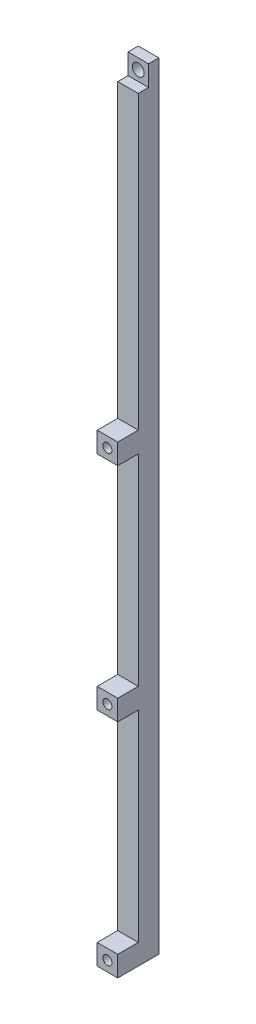
ISO-10303-21;
HEADER;
FILE_DESCRIPTION(('STEP AP214'),'2;1');
FILE_NAME('part.step','',(''),(''),'','','');
FILE_SCHEMA(('AUTOMOTIVE_DESIGN { 1 0 10303 214 1 1 1 1 }'));
ENDSEC;
DATA;
#1=APPLICATION_CONTEXT('core data for automotive mechanical design processes');
#2=APPLICATION_PROTOCOL_DEFINITION('international standard','automotive_design',2000,#1);
#3=PRODUCT_CONTEXT('',#1,'mechanical');
#4=PRODUCT('Part','Part','',(#3));
#5=PRODUCT_RELATED_PRODUCT_CATEGORY('part','',(#4));
#6=PRODUCT_DEFINITION_FORMATION('','',#4);
#7=PRODUCT_DEFINITION_CONTEXT('part definition',#1,'design');
#8=PRODUCT_DEFINITION('design','',#6,#7);
#9=PRODUCT_DEFINITION_SHAPE('','',#8);
#10=(LENGTH_UNIT() NAMED_UNIT(*) SI_UNIT(.MILLI.,.METRE.));
#11=(NAMED_UNIT(*) PLANE_ANGLE_UNIT() SI_UNIT($,.RADIAN.));
#12=(NAMED_UNIT(*) SI_UNIT($,.STERADIAN.) SOLID_ANGLE_UNIT());
#13=UNCERTAINTY_MEASURE_WITH_UNIT(LENGTH_MEASURE(1.E-05),#10,'distance_accuracy_value','');
#14=(GEOMETRIC_REPRESENTATION_CONTEXT(3) GLOBAL_UNCERTAINTY_ASSIGNED_CONTEXT((#13)) GLOBAL_UNIT_ASSIGNED_CONTEXT((#10,
#11,#12)) REPRESENTATION_CONTEXT('',''));
#15=CARTESIAN_POINT('',(0.,0.,0.));
#16=DIRECTION('',(0.,0.,1.));
#17=DIRECTION('',(1.,0.,0.));
#18=AXIS2_PLACEMENT_3D('',#15,#16,#17);
#19=CARTESIAN_POINT('',(0.,240.03,0.));
#20=DIRECTION('',(0.,0.,-1.));
#21=DIRECTION('',(-1.,0.,0.));
#22=AXIS2_PLACEMENT_3D('',#19,#20,#21);
#23=PLANE('',#22);
#24=CARTESIAN_POINT('',(3.175,140.335,0.));
#25=DIRECTION('',(0.,0.,1.));
#26=DIRECTION('',(1.,0.,0.));
#27=AXIS2_PLACEMENT_3D('',#24,#25,#26);
#28=CIRCLE('',#27,1.397);
#29=CARTESIAN_POINT('',(4.57199999999999,140.335,0.));
#30=VERTEX_POINT('',#29);
#31=EDGE_CURVE('E396',#30,#30,#28,.T.);
#32=ORIENTED_EDGE('',*,*,#31,.F.);
#33=EDGE_LOOP('',(#32));
#34=FACE_BOUND('',#33,.T.);
#35=DIRECTION('',(0.,-1.,0.));
#36=VECTOR('',#35,1.);
#37=CARTESIAN_POINT('',(6.35,240.03,0.));
#38=LINE('',#37,#36);
#39=CARTESIAN_POINT('',(6.35,143.50989967,0.));
#40=VERTEX_POINT('',#39);
#41=CARTESIAN_POINT('',(6.35,137.16010033,0.));
#42=VERTEX_POINT('',#41);
#43=EDGE_CURVE('E206',#40,#42,#38,.T.);
#44=ORIENTED_EDGE('',*,*,#43,.F.);
#45=DIRECTION('',(-1.,0.,0.));
#46=VECTOR('',#45,1.);
#47=CARTESIAN_POINT('',(0.,143.50989967,0.));
#48=LINE('',#47,#46);
#49=CARTESIAN_POINT('',(0.,143.50989967,0.));
#50=VERTEX_POINT('',#49);
#51=EDGE_CURVE('E127',#40,#50,#48,.T.);
#52=ORIENTED_EDGE('',*,*,#51,.T.);
#53=DIRECTION('',(0.,-1.,0.));
#54=VECTOR('',#53,1.);
#55=CARTESIAN_POINT('',(0.,240.03,0.));
#56=LINE('',#55,#54);
#57=CARTESIAN_POINT('',(0.,137.16010033,0.));
#58=VERTEX_POINT('',#57);
#59=EDGE_CURVE('E202',#50,#58,#56,.T.);
#60=ORIENTED_EDGE('',*,*,#59,.T.);
#61=DIRECTION('',(1.,0.,0.));
#62=VECTOR('',#61,1.);
#63=CARTESIAN_POINT('',(0.,137.16010033,0.));
#64=LINE('',#63,#62);
#65=EDGE_CURVE('E201',#58,#42,#64,.T.);
#66=ORIENTED_EDGE('',*,*,#65,.T.);
#67=EDGE_LOOP('',(#44,#52,#60,#66));
#68=FACE_BOUND('',#67,.T.);
#69=ADVANCED_FACE('F109',(#34,#68),#23,.F.);
#70=CARTESIAN_POINT('',(3.175,3.174949835,0.));
#71=DIRECTION('',(0.,0.,1.));
#72=DIRECTION('',(1.,0.,0.));
#73=AXIS2_PLACEMENT_3D('',#70,#71,#72);
#74=CIRCLE('',#73,1.397);
#75=CARTESIAN_POINT('',(4.572,3.174949835,0.));
#76=VERTEX_POINT('',#75);
#77=EDGE_CURVE('E393',#76,#76,#74,.T.);
#78=ORIENTED_EDGE('',*,*,#77,.F.);
#79=EDGE_LOOP('',(#78));
#80=FACE_BOUND('',#79,.T.);
#81=DIRECTION('',(1.,0.,0.));
#82=VECTOR('',#81,1.);
#83=CARTESIAN_POINT('',(0.,6.34989966999999,0.));
#84=LINE('',#83,#82);
#85=CARTESIAN_POINT('',(0.,6.34989967,0.));
#86=VERTEX_POINT('',#85);
#87=CARTESIAN_POINT('',(6.35,6.34989967,0.));
#88=VERTEX_POINT('',#87);
#89=EDGE_CURVE('E238',#86,#88,#84,.T.);
#90=ORIENTED_EDGE('',*,*,#89,.F.);
#91=CARTESIAN_POINT('',(0.,0.,0.));
#92=VERTEX_POINT('',#91);
#93=EDGE_CURVE('E197',#86,#92,#56,.T.);
#94=ORIENTED_EDGE('',*,*,#93,.T.);
#95=DIRECTION('',(1.,0.,0.));
#96=VECTOR('',#95,1.);
#97=CARTESIAN_POINT('',(0.,0.,0.));
#98=LINE('',#97,#96);
#99=CARTESIAN_POINT('',(6.35,0.,0.));
#100=VERTEX_POINT('',#99);
#101=EDGE_CURVE('E200',#92,#100,#98,.T.);
#102=ORIENTED_EDGE('',*,*,#101,.T.);
#103=EDGE_CURVE('E186',#88,#100,#38,.T.);
#104=ORIENTED_EDGE('',*,*,#103,.F.);
#105=EDGE_LOOP('',(#90,#94,#102,#104));
#106=FACE_BOUND('',#105,.T.);
#107=ADVANCED_FACE('F372',(#80,#106),#23,.F.);
#108=CARTESIAN_POINT('',(3.175,71.755,0.));
#109=DIRECTION('',(0.,0.,1.));
#110=DIRECTION('',(1.,0.,0.));
#111=AXIS2_PLACEMENT_3D('',#108,#109,#110);
#112=CIRCLE('',#111,1.397);
#113=CARTESIAN_POINT('',(4.572,71.755,0.));
#114=VERTEX_POINT('',#113);
#115=EDGE_CURVE('E387',#114,#114,#112,.T.);
#116=ORIENTED_EDGE('',*,*,#115,.F.);
#117=EDGE_LOOP('',(#116));
#118=FACE_BOUND('',#117,.T.);
#119=CARTESIAN_POINT('',(0.,74.92989967,0.));
#120=VERTEX_POINT('',#119);
#121=CARTESIAN_POINT('',(0.,68.58010033,0.));
#122=VERTEX_POINT('',#121);
#123=EDGE_CURVE('E203',#120,#122,#56,.T.);
#124=ORIENTED_EDGE('',*,*,#123,.T.);
#125=DIRECTION('',(1.,0.,0.));
#126=VECTOR('',#125,1.);
#127=CARTESIAN_POINT('',(0.,68.58010033,0.));
#128=LINE('',#127,#126);
#129=CARTESIAN_POINT('',(6.35,68.58010033,0.));
#130=VERTEX_POINT('',#129);
#131=EDGE_CURVE('E195',#122,#130,#128,.T.);
#132=ORIENTED_EDGE('',*,*,#131,.T.);
#133=CARTESIAN_POINT('',(6.35,74.92989967,0.));
#134=VERTEX_POINT('',#133);
#135=EDGE_CURVE('E207',#134,#130,#38,.T.);
#136=ORIENTED_EDGE('',*,*,#135,.F.);
#137=DIRECTION('',(1.,0.,0.));
#138=VECTOR('',#137,1.);
#139=CARTESIAN_POINT('',(0.,74.92989967,0.));
#140=LINE('',#139,#138);
#141=EDGE_CURVE('E255',#120,#134,#140,.T.);
#142=ORIENTED_EDGE('',*,*,#141,.F.);
#143=EDGE_LOOP('',(#124,#132,#136,#142));
#144=FACE_BOUND('',#143,.T.);
#145=ADVANCED_FACE('F308',(#118,#144),#23,.F.);
#146=CARTESIAN_POINT('',(0.,240.03,0.));
#147=DIRECTION('',(1.,0.,0.));
#148=DIRECTION('',(0.,0.,-1.));
#149=AXIS2_PLACEMENT_3D('',#146,#147,#148);
#150=PLANE('',#149);
#151=ORIENTED_EDGE('',*,*,#59,.F.);
#152=DIRECTION('',(0.,0.,1.));
#153=VECTOR('',#152,1.);
#154=CARTESIAN_POINT('',(0.,143.50989967,0.));
#155=LINE('',#154,#153);
#156=CARTESIAN_POINT('',(0.,143.50989967,-6.35010033));
#157=VERTEX_POINT('',#156);
#158=EDGE_CURVE('E12',#157,#50,#155,.T.);
#159=ORIENTED_EDGE('',*,*,#158,.F.);
#160=DIRECTION('',(0.,1.,0.));
#161=VECTOR('',#160,1.);
#162=CARTESIAN_POINT('',(0.,143.51,-6.35010033));
#163=LINE('',#162,#161);
#164=CARTESIAN_POINT('',(0.,233.67989967,-6.35010033));
#165=VERTEX_POINT('',#164);
#166=EDGE_CURVE('E172',#165,#157,#163,.F.);
#167=ORIENTED_EDGE('',*,*,#166,.F.);
#168=DIRECTION('',(0.,0.,-1.));
#169=VECTOR('',#168,1.);
#170=CARTESIAN_POINT('',(0.,233.67989967,0.));
#171=LINE('',#170,#169);
#172=CARTESIAN_POINT('',(0.,233.67989967,-9.52510033));
#173=VERTEX_POINT('',#172);
#174=EDGE_CURVE('E193',#165,#173,#171,.T.);
#175=ORIENTED_EDGE('',*,*,#174,.T.);
#176=DIRECTION('',(0.,-1.,0.));
#177=VECTOR('',#176,1.);
#178=CARTESIAN_POINT('',(0.,0.,-9.52510032999994));
#179=LINE('',#178,#177);
#180=CARTESIAN_POINT('',(0.,240.03,-9.52510033));
#181=VERTEX_POINT('',#180);
#182=EDGE_CURVE('E171',#181,#173,#179,.T.);
#183=ORIENTED_EDGE('',*,*,#182,.F.);
#184=DIRECTION('',(0.,0.,1.));
#185=VECTOR('',#184,1.);
#186=CARTESIAN_POINT('',(0.,240.03,0.));
#187=LINE('',#186,#185);
#188=CARTESIAN_POINT('',(0.,240.03,-12.7));
#189=VERTEX_POINT('',#188);
#190=EDGE_CURVE('E113',#189,#181,#187,.T.);
#191=ORIENTED_EDGE('',*,*,#190,.F.);
#192=DIRECTION('',(0.,-1.,0.));
#193=VECTOR('',#192,1.);
#194=CARTESIAN_POINT('',(0.,240.03,-12.7));
#195=LINE('',#194,#193);
#196=CARTESIAN_POINT('',(0.,0.,-12.7));
#197=VERTEX_POINT('',#196);
#198=EDGE_CURVE('E194',#189,#197,#195,.T.);
#199=ORIENTED_EDGE('',*,*,#198,.T.);
#200=DIRECTION('',(0.,0.,1.));
#201=VECTOR('',#200,1.);
#202=CARTESIAN_POINT('',(0.,0.,0.));
#203=LINE('',#202,#201);
#204=EDGE_CURVE('E232',#197,#92,#203,.T.);
#205=ORIENTED_EDGE('',*,*,#204,.T.);
#206=ORIENTED_EDGE('',*,*,#93,.F.);
#207=DIRECTION('',(0.,0.,-1.));
#208=VECTOR('',#207,1.);
#209=CARTESIAN_POINT('',(0.,6.34989967,0.));
#210=LINE('',#209,#208);
#211=CARTESIAN_POINT('',(0.,6.34989967,-6.35010032999999));
#212=VERTEX_POINT('',#211);
#213=EDGE_CURVE('E228',#86,#212,#210,.T.);
#214=ORIENTED_EDGE('',*,*,#213,.T.);
#215=DIRECTION('',(0.,-1.,0.));
#216=VECTOR('',#215,1.);
#217=CARTESIAN_POINT('',(0.,68.58,-6.35010033));
#218=LINE('',#217,#216);
#219=CARTESIAN_POINT('',(0.,68.58010033,-6.35010033));
#220=VERTEX_POINT('',#219);
#221=EDGE_CURVE('E223',#220,#212,#218,.T.);
#222=ORIENTED_EDGE('',*,*,#221,.F.);
#223=DIRECTION('',(0.,0.,-1.));
#224=VECTOR('',#223,1.);
#225=CARTESIAN_POINT('',(0.,68.58010033,0.));
#226=LINE('',#225,#224);
#227=EDGE_CURVE('E235',#122,#220,#226,.T.);
#228=ORIENTED_EDGE('',*,*,#227,.F.);
#229=ORIENTED_EDGE('',*,*,#123,.F.);
#230=DIRECTION('',(0.,0.,-1.));
#231=VECTOR('',#230,1.);
#232=CARTESIAN_POINT('',(0.,74.92989967,0.));
#233=LINE('',#232,#231);
#234=CARTESIAN_POINT('',(0.,74.92989967,-6.35010032999999));
#235=VERTEX_POINT('',#234);
#236=EDGE_CURVE('E231',#120,#235,#233,.T.);
#237=ORIENTED_EDGE('',*,*,#236,.T.);
#238=DIRECTION('',(0.,-1.,0.));
#239=VECTOR('',#238,1.);
#240=CARTESIAN_POINT('',(0.,137.16,-6.35010033));
#241=LINE('',#240,#239);
#242=CARTESIAN_POINT('',(0.,137.16010033,-6.35010033));
#243=VERTEX_POINT('',#242);
#244=EDGE_CURVE('E270',#243,#235,#241,.T.);
#245=ORIENTED_EDGE('',*,*,#244,.F.);
#246=DIRECTION('',(0.,0.,-1.));
#247=VECTOR('',#246,1.);
#248=CARTESIAN_POINT('',(0.,137.16010033,0.));
#249=LINE('',#248,#247);
#250=EDGE_CURVE('E213',#58,#243,#249,.T.);
#251=ORIENTED_EDGE('',*,*,#250,.F.);
#252=EDGE_LOOP('',(#151,#159,#167,#175,#183,#191,#199,#205,#206,#214,#222,#228,#229,#237,#245,#251));
#253=FACE_BOUND('',#252,.T.);
#254=ADVANCED_FACE('F111',(#253),#150,.F.);
#255=CARTESIAN_POINT('',(6.35,240.03,0.));
#256=DIRECTION('',(-1.,0.,0.));
#257=DIRECTION('',(0.,0.,1.));
#258=AXIS2_PLACEMENT_3D('',#255,#256,#257);
#259=PLANE('',#258);
#260=DIRECTION('',(0.,1.,0.));
#261=VECTOR('',#260,1.);
#262=CARTESIAN_POINT('',(6.35,143.51,-6.35010033));
#263=LINE('',#262,#261);
#264=CARTESIAN_POINT('',(6.35,233.67989967,-6.35010033));
#265=VERTEX_POINT('',#264);
#266=CARTESIAN_POINT('',(6.35,143.50989967,-6.35010033));
#267=VERTEX_POINT('',#266);
#268=EDGE_CURVE('E275',#265,#267,#263,.F.);
#269=ORIENTED_EDGE('',*,*,#268,.T.);
#270=DIRECTION('',(0.,0.,1.));
#271=VECTOR('',#270,1.);
#272=CARTESIAN_POINT('',(6.35,143.50989967,0.));
#273=LINE('',#272,#271);
#274=EDGE_CURVE('E288',#267,#40,#273,.T.);
#275=ORIENTED_EDGE('',*,*,#274,.T.);
#276=ORIENTED_EDGE('',*,*,#43,.T.);
#277=DIRECTION('',(0.,0.,-1.));
#278=VECTOR('',#277,1.);
#279=CARTESIAN_POINT('',(6.35,137.16010033,0.));
#280=LINE('',#279,#278);
#281=CARTESIAN_POINT('',(6.35,137.16010033,-6.35010033));
#282=VERTEX_POINT('',#281);
#283=EDGE_CURVE('E247',#42,#282,#280,.T.);
#284=ORIENTED_EDGE('',*,*,#283,.T.);
#285=DIRECTION('',(0.,-1.,0.));
#286=VECTOR('',#285,1.);
#287=CARTESIAN_POINT('',(6.35,137.16,-6.35010033));
#288=LINE('',#287,#286);
#289=CARTESIAN_POINT('',(6.35,74.92989967,-6.35010032999999));
#290=VERTEX_POINT('',#289);
#291=EDGE_CURVE('E250',#282,#290,#288,.T.);
#292=ORIENTED_EDGE('',*,*,#291,.T.);
#293=DIRECTION('',(0.,0.,-1.));
#294=VECTOR('',#293,1.);
#295=CARTESIAN_POINT('',(6.35,74.92989967,0.));
#296=LINE('',#295,#294);
#297=EDGE_CURVE('E251',#134,#290,#296,.T.);
#298=ORIENTED_EDGE('',*,*,#297,.F.);
#299=ORIENTED_EDGE('',*,*,#135,.T.);
#300=DIRECTION('',(0.,0.,-1.));
#301=VECTOR('',#300,1.);
#302=CARTESIAN_POINT('',(6.35,68.58010033,0.));
#303=LINE('',#302,#301);
#304=CARTESIAN_POINT('',(6.35,68.58010033,-6.35010033));
#305=VERTEX_POINT('',#304);
#306=EDGE_CURVE('E242',#130,#305,#303,.T.);
#307=ORIENTED_EDGE('',*,*,#306,.T.);
#308=DIRECTION('',(0.,-1.,0.));
#309=VECTOR('',#308,1.);
#310=CARTESIAN_POINT('',(6.35,68.58,-6.35010033));
#311=LINE('',#310,#309);
#312=CARTESIAN_POINT('',(6.35,6.34989966999999,-6.35010032999999));
#313=VERTEX_POINT('',#312);
#314=EDGE_CURVE('E205',#305,#313,#311,.T.);
#315=ORIENTED_EDGE('',*,*,#314,.T.);
#316=DIRECTION('',(0.,0.,-1.));
#317=VECTOR('',#316,1.);
#318=CARTESIAN_POINT('',(6.35,6.34989966999999,0.));
#319=LINE('',#318,#317);
#320=EDGE_CURVE('E227',#88,#313,#319,.T.);
#321=ORIENTED_EDGE('',*,*,#320,.F.);
#322=ORIENTED_EDGE('',*,*,#103,.T.);
#323=DIRECTION('',(0.,0.,-1.));
#324=VECTOR('',#323,1.);
#325=CARTESIAN_POINT('',(6.35,0.,0.));
#326=LINE('',#325,#324);
#327=CARTESIAN_POINT('',(6.35,0.,-12.7));
#328=VERTEX_POINT('',#327);
#329=EDGE_CURVE('E180',#100,#328,#326,.T.);
#330=ORIENTED_EDGE('',*,*,#329,.T.);
#331=DIRECTION('',(0.,-1.,0.));
#332=VECTOR('',#331,1.);
#333=CARTESIAN_POINT('',(6.35,240.03,-12.7));
#334=LINE('',#333,#332);
#335=CARTESIAN_POINT('',(6.35,240.03,-12.7));
#336=VERTEX_POINT('',#335);
#337=EDGE_CURVE('E183',#336,#328,#334,.T.);
#338=ORIENTED_EDGE('',*,*,#337,.F.);
#339=DIRECTION('',(0.,0.,-1.));
#340=VECTOR('',#339,1.);
#341=CARTESIAN_POINT('',(6.35,240.03,0.));
#342=LINE('',#341,#340);
#343=CARTESIAN_POINT('',(6.35,240.03,-9.52510033));
#344=VERTEX_POINT('',#343);
#345=EDGE_CURVE('E178',#344,#336,#342,.T.);
#346=ORIENTED_EDGE('',*,*,#345,.F.);
#347=DIRECTION('',(0.,-1.,0.));
#348=VECTOR('',#347,1.);
#349=CARTESIAN_POINT('',(6.35,0.,-9.52510032999994));
#350=LINE('',#349,#348);
#351=CARTESIAN_POINT('',(6.35,233.67989967,-9.52510033));
#352=VERTEX_POINT('',#351);
#353=EDGE_CURVE('E168',#344,#352,#350,.T.);
#354=ORIENTED_EDGE('',*,*,#353,.T.);
#355=DIRECTION('',(0.,0.,-1.));
#356=VECTOR('',#355,1.);
#357=CARTESIAN_POINT('',(6.35,233.67989967,0.));
#358=LINE('',#357,#356);
#359=EDGE_CURVE('E152',#265,#352,#358,.T.);
#360=ORIENTED_EDGE('',*,*,#359,.F.);
#361=EDGE_LOOP('',(#269,#275,#276,#284,#292,#298,#299,#307,#315,#321,#322,#330,#338,#346,#354,#360));
#362=FACE_BOUND('',#361,.T.);
#363=ADVANCED_FACE('F175',(#362),#259,.F.);
#364=CARTESIAN_POINT('',(0.,240.03,-12.7));
#365=DIRECTION('',(0.,0.,1.));
#366=DIRECTION('',(1.,0.,0.));
#367=AXIS2_PLACEMENT_3D('',#364,#365,#366);
#368=PLANE('',#367);
#369=CARTESIAN_POINT('',(3.175,236.854949835,-12.7));
#370=DIRECTION('',(0.,0.,1.));
#371=DIRECTION('',(1.,0.,0.));
#372=AXIS2_PLACEMENT_3D('',#369,#370,#371);
#373=CIRCLE('',#372,1.8288);
#374=CARTESIAN_POINT('',(5.00379999999999,236.854949835,-12.7));
#375=VERTEX_POINT('',#374);
#376=EDGE_CURVE('E565',#375,#375,#373,.T.);
#377=ORIENTED_EDGE('',*,*,#376,.T.);
#378=EDGE_LOOP('',(#377));
#379=FACE_BOUND('',#378,.T.);
#380=CARTESIAN_POINT('',(3.175,140.335,-12.7));
#381=DIRECTION('',(0.,0.,1.));
#382=DIRECTION('',(1.,0.,0.));
#383=AXIS2_PLACEMENT_3D('',#380,#381,#382);
#384=CIRCLE('',#383,1.397);
#385=CARTESIAN_POINT('',(4.57199999999999,140.335,-12.7));
#386=VERTEX_POINT('',#385);
#387=EDGE_CURVE('E390',#386,#386,#384,.T.);
#388=ORIENTED_EDGE('',*,*,#387,.T.);
#389=EDGE_LOOP('',(#388));
#390=FACE_BOUND('',#389,.T.);
#391=CARTESIAN_POINT('',(3.175,71.755,-12.7));
#392=DIRECTION('',(0.,0.,1.));
#393=DIRECTION('',(1.,0.,0.));
#394=AXIS2_PLACEMENT_3D('',#391,#392,#393);
#395=CIRCLE('',#394,1.397);
#396=CARTESIAN_POINT('',(4.57199999999999,71.755,-12.7));
#397=VERTEX_POINT('',#396);
#398=EDGE_CURVE('E389',#397,#397,#395,.T.);
#399=ORIENTED_EDGE('',*,*,#398,.T.);
#400=EDGE_LOOP('',(#399));
#401=FACE_BOUND('',#400,.T.);
#402=CARTESIAN_POINT('',(3.175,3.174949835,-12.7));
#403=DIRECTION('',(0.,0.,1.));
#404=DIRECTION('',(1.,0.,0.));
#405=AXIS2_PLACEMENT_3D('',#402,#403,#404);
#406=CIRCLE('',#405,1.397);
#407=CARTESIAN_POINT('',(4.572,3.174949835,-12.7));
#408=VERTEX_POINT('',#407);
#409=EDGE_CURVE('E219',#408,#408,#406,.T.);
#410=ORIENTED_EDGE('',*,*,#409,.T.);
#411=EDGE_LOOP('',(#410));
#412=FACE_BOUND('',#411,.T.);
#413=DIRECTION('',(-1.,0.,0.));
#414=VECTOR('',#413,1.);
#415=CARTESIAN_POINT('',(0.,0.,-12.7));
#416=LINE('',#415,#414);
#417=EDGE_CURVE('E179',#328,#197,#416,.T.);
#418=ORIENTED_EDGE('',*,*,#417,.T.);
#419=ORIENTED_EDGE('',*,*,#198,.F.);
#420=DIRECTION('',(-1.,0.,0.));
#421=VECTOR('',#420,1.);
#422=CARTESIAN_POINT('',(0.,240.03,-12.7));
#423=LINE('',#422,#421);
#424=EDGE_CURVE('E208',#336,#189,#423,.T.);
#425=ORIENTED_EDGE('',*,*,#424,.F.);
#426=ORIENTED_EDGE('',*,*,#337,.T.);
#427=EDGE_LOOP('',(#418,#419,#425,#426));
#428=FACE_BOUND('',#427,.T.);
#429=ADVANCED_FACE('F405',(#379,#390,#401,#412,#428),#368,.F.);
#430=CARTESIAN_POINT('',(0.,240.03,0.));
#431=DIRECTION('',(0.,-1.,0.));
#432=DIRECTION('',(0.,0.,-1.));
#433=AXIS2_PLACEMENT_3D('',#430,#431,#432);
#434=PLANE('',#433);
#435=ORIENTED_EDGE('',*,*,#190,.T.);
#436=DIRECTION('',(1.,0.,0.));
#437=VECTOR('',#436,1.);
#438=CARTESIAN_POINT('',(0.,240.03,-9.52510033));
#439=LINE('',#438,#437);
#440=EDGE_CURVE('E209',#181,#344,#439,.T.);
#441=ORIENTED_EDGE('',*,*,#440,.T.);
#442=ORIENTED_EDGE('',*,*,#345,.T.);
#443=ORIENTED_EDGE('',*,*,#424,.T.);
#444=EDGE_LOOP('',(#435,#441,#442,#443));
#445=FACE_BOUND('',#444,.T.);
#446=ADVANCED_FACE('F436',(#445),#434,.F.);
#447=CARTESIAN_POINT('',(0.,0.,0.));
#448=DIRECTION('',(0.,-1.,0.));
#449=DIRECTION('',(0.,0.,-1.));
#450=AXIS2_PLACEMENT_3D('',#447,#448,#449);
#451=PLANE('',#450);
#452=ORIENTED_EDGE('',*,*,#204,.F.);
#453=ORIENTED_EDGE('',*,*,#417,.F.);
#454=ORIENTED_EDGE('',*,*,#329,.F.);
#455=ORIENTED_EDGE('',*,*,#101,.F.);
#456=EDGE_LOOP('',(#452,#453,#454,#455));
#457=FACE_BOUND('',#456,.T.);
#458=ADVANCED_FACE('F438',(#457),#451,.T.);
#459=CARTESIAN_POINT('',(6.35,137.16010033,0.));
#460=DIRECTION('',(0.,1.,0.));
#461=DIRECTION('',(0.,0.,1.));
#462=AXIS2_PLACEMENT_3D('',#459,#460,#461);
#463=PLANE('',#462);
#464=ORIENTED_EDGE('',*,*,#250,.T.);
#465=DIRECTION('',(-1.,0.,0.));
#466=VECTOR('',#465,1.);
#467=CARTESIAN_POINT('',(6.35,137.16010033,-6.35010033));
#468=LINE('',#467,#466);
#469=EDGE_CURVE('E239',#282,#243,#468,.T.);
#470=ORIENTED_EDGE('',*,*,#469,.F.);
#471=ORIENTED_EDGE('',*,*,#283,.F.);
#472=ORIENTED_EDGE('',*,*,#65,.F.);
#473=EDGE_LOOP('',(#464,#470,#471,#472));
#474=FACE_BOUND('',#473,.T.);
#475=ADVANCED_FACE('F369',(#474),#463,.F.);
#476=CARTESIAN_POINT('',(6.35,74.92989967,0.));
#477=DIRECTION('',(0.,1.,0.));
#478=DIRECTION('',(0.,0.,1.));
#479=AXIS2_PLACEMENT_3D('',#476,#477,#478);
#480=PLANE('',#479);
#481=ORIENTED_EDGE('',*,*,#141,.T.);
#482=ORIENTED_EDGE('',*,*,#297,.T.);
#483=DIRECTION('',(-1.,0.,0.));
#484=VECTOR('',#483,1.);
#485=CARTESIAN_POINT('',(6.35,74.92989967,-6.35010032999999));
#486=LINE('',#485,#484);
#487=EDGE_CURVE('E254',#290,#235,#486,.T.);
#488=ORIENTED_EDGE('',*,*,#487,.T.);
#489=ORIENTED_EDGE('',*,*,#236,.F.);
#490=EDGE_LOOP('',(#481,#482,#488,#489));
#491=FACE_BOUND('',#490,.T.);
#492=ADVANCED_FACE('F444',(#491),#480,.T.);
#493=CARTESIAN_POINT('',(6.35,137.16,-6.35010033));
#494=DIRECTION('',(0.,0.,-1.));
#495=DIRECTION('',(-1.,0.,0.));
#496=AXIS2_PLACEMENT_3D('',#493,#494,#495);
#497=PLANE('',#496);
#498=ORIENTED_EDGE('',*,*,#244,.T.);
#499=ORIENTED_EDGE('',*,*,#487,.F.);
#500=ORIENTED_EDGE('',*,*,#291,.F.);
#501=ORIENTED_EDGE('',*,*,#469,.T.);
#502=EDGE_LOOP('',(#498,#499,#500,#501));
#503=FACE_BOUND('',#502,.T.);
#504=ADVANCED_FACE('F427',(#503),#497,.F.);
#505=CARTESIAN_POINT('',(6.35,68.58010033,0.));
#506=DIRECTION('',(0.,1.,0.));
#507=DIRECTION('',(0.,0.,1.));
#508=AXIS2_PLACEMENT_3D('',#505,#506,#507);
#509=PLANE('',#508);
#510=ORIENTED_EDGE('',*,*,#227,.T.);
#511=DIRECTION('',(-1.,0.,0.));
#512=VECTOR('',#511,1.);
#513=CARTESIAN_POINT('',(6.35,68.58010033,-6.35010033));
#514=LINE('',#513,#512);
#515=EDGE_CURVE('E190',#305,#220,#514,.T.);
#516=ORIENTED_EDGE('',*,*,#515,.F.);
#517=ORIENTED_EDGE('',*,*,#306,.F.);
#518=ORIENTED_EDGE('',*,*,#131,.F.);
#519=EDGE_LOOP('',(#510,#516,#517,#518));
#520=FACE_BOUND('',#519,.T.);
#521=ADVANCED_FACE('F423',(#520),#509,.F.);
#522=CARTESIAN_POINT('',(6.35,6.34989967,0.));
#523=DIRECTION('',(0.,1.,0.));
#524=DIRECTION('',(0.,0.,1.));
#525=AXIS2_PLACEMENT_3D('',#522,#523,#524);
#526=PLANE('',#525);
#527=ORIENTED_EDGE('',*,*,#89,.T.);
#528=ORIENTED_EDGE('',*,*,#320,.T.);
#529=DIRECTION('',(-1.,0.,0.));
#530=VECTOR('',#529,1.);
#531=CARTESIAN_POINT('',(6.35,6.34989967,-6.35010032999999));
#532=LINE('',#531,#530);
#533=EDGE_CURVE('E224',#313,#212,#532,.T.);
#534=ORIENTED_EDGE('',*,*,#533,.T.);
#535=ORIENTED_EDGE('',*,*,#213,.F.);
#536=EDGE_LOOP('',(#527,#528,#534,#535));
#537=FACE_BOUND('',#536,.T.);
#538=ADVANCED_FACE('F426',(#537),#526,.T.);
#539=CARTESIAN_POINT('',(6.35,68.58,-6.35010033));
#540=DIRECTION('',(0.,0.,-1.));
#541=DIRECTION('',(-1.,0.,0.));
#542=AXIS2_PLACEMENT_3D('',#539,#540,#541);
#543=PLANE('',#542);
#544=ORIENTED_EDGE('',*,*,#221,.T.);
#545=ORIENTED_EDGE('',*,*,#533,.F.);
#546=ORIENTED_EDGE('',*,*,#314,.F.);
#547=ORIENTED_EDGE('',*,*,#515,.T.);
#548=EDGE_LOOP('',(#544,#545,#546,#547));
#549=FACE_BOUND('',#548,.T.);
#550=ADVANCED_FACE('F429',(#549),#543,.F.);
#551=CARTESIAN_POINT('',(6.35,0.,-9.52510032999994));
#552=DIRECTION('',(0.,0.,-1.));
#553=DIRECTION('',(0.,1.,0.));
#554=AXIS2_PLACEMENT_3D('',#551,#552,#553);
#555=PLANE('',#554);
#556=CARTESIAN_POINT('',(3.175,236.854949835,-9.52510032999993));
#557=DIRECTION('',(0.,0.,1.));
#558=DIRECTION('',(1.,0.,0.));
#559=AXIS2_PLACEMENT_3D('',#556,#557,#558);
#560=CIRCLE('',#559,1.82879999999999);
#561=CARTESIAN_POINT('',(5.00379999999999,236.854949835,-9.52510032999993));
#562=VERTEX_POINT('',#561);
#563=EDGE_CURVE('E568',#562,#562,#560,.T.);
#564=ORIENTED_EDGE('',*,*,#563,.F.);
#565=EDGE_LOOP('',(#564));
#566=FACE_BOUND('',#565,.T.);
#567=ORIENTED_EDGE('',*,*,#182,.T.);
#568=DIRECTION('',(-1.,0.,0.));
#569=VECTOR('',#568,1.);
#570=CARTESIAN_POINT('',(6.35,233.67989967,-9.52510033));
#571=LINE('',#570,#569);
#572=EDGE_CURVE('E156',#352,#173,#571,.T.);
#573=ORIENTED_EDGE('',*,*,#572,.F.);
#574=ORIENTED_EDGE('',*,*,#353,.F.);
#575=ORIENTED_EDGE('',*,*,#440,.F.);
#576=EDGE_LOOP('',(#567,#573,#574,#575));
#577=FACE_BOUND('',#576,.T.);
#578=ADVANCED_FACE('F167',(#566,#577),#555,.F.);
#579=CARTESIAN_POINT('',(6.35,233.67989967,0.));
#580=DIRECTION('',(0.,1.,0.));
#581=DIRECTION('',(0.,0.,1.));
#582=AXIS2_PLACEMENT_3D('',#579,#580,#581);
#583=PLANE('',#582);
#584=DIRECTION('',(1.,0.,0.));
#585=VECTOR('',#584,1.);
#586=CARTESIAN_POINT('',(6.35,233.67989967,-6.35010033));
#587=LINE('',#586,#585);
#588=EDGE_CURVE('E158',#165,#265,#587,.T.);
#589=ORIENTED_EDGE('',*,*,#588,.T.);
#590=ORIENTED_EDGE('',*,*,#359,.T.);
#591=ORIENTED_EDGE('',*,*,#572,.T.);
#592=ORIENTED_EDGE('',*,*,#174,.F.);
#593=EDGE_LOOP('',(#589,#590,#591,#592));
#594=FACE_BOUND('',#593,.T.);
#595=ADVANCED_FACE('F154',(#594),#583,.T.);
#596=CARTESIAN_POINT('',(6.35,143.51,-6.35010033));
#597=DIRECTION('',(0.,0.,-1.));
#598=DIRECTION('',(-1.,0.,0.));
#599=AXIS2_PLACEMENT_3D('',#596,#597,#598);
#600=PLANE('',#599);
#601=ORIENTED_EDGE('',*,*,#166,.T.);
#602=DIRECTION('',(-1.,0.,0.));
#603=VECTOR('',#602,1.);
#604=CARTESIAN_POINT('',(6.35,143.50989967,-6.35010033));
#605=LINE('',#604,#603);
#606=EDGE_CURVE('E119',#267,#157,#605,.T.);
#607=ORIENTED_EDGE('',*,*,#606,.F.);
#608=ORIENTED_EDGE('',*,*,#268,.F.);
#609=ORIENTED_EDGE('',*,*,#588,.F.);
#610=EDGE_LOOP('',(#601,#607,#608,#609));
#611=FACE_BOUND('',#610,.T.);
#612=ADVANCED_FACE('F419',(#611),#600,.F.);
#613=CARTESIAN_POINT('',(6.35,143.50989967,0.));
#614=DIRECTION('',(0.,-1.,0.));
#615=DIRECTION('',(0.,0.,-1.));
#616=AXIS2_PLACEMENT_3D('',#613,#614,#615);
#617=PLANE('',#616);
#618=ORIENTED_EDGE('',*,*,#274,.F.);
#619=ORIENTED_EDGE('',*,*,#606,.T.);
#620=ORIENTED_EDGE('',*,*,#158,.T.);
#621=ORIENTED_EDGE('',*,*,#51,.F.);
#622=EDGE_LOOP('',(#618,#619,#620,#621));
#623=FACE_BOUND('',#622,.T.);
#624=ADVANCED_FACE('F294',(#623),#617,.F.);
#625=CARTESIAN_POINT('',(3.175,3.174949835,0.));
#626=DIRECTION('',(0.,0.,1.));
#627=DIRECTION('',(1.,0.,0.));
#628=AXIS2_PLACEMENT_3D('',#625,#626,#627);
#629=CYLINDRICAL_SURFACE('',#628,1.397);
#630=ORIENTED_EDGE('',*,*,#409,.F.);
#631=EDGE_LOOP('',(#630));
#632=FACE_BOUND('',#631,.T.);
#633=ORIENTED_EDGE('',*,*,#77,.T.);
#634=EDGE_LOOP('',(#633));
#635=FACE_BOUND('',#634,.T.);
#636=ADVANCED_FACE('F408',(#632,#635),#629,.F.);
#637=CARTESIAN_POINT('',(3.175,71.755,0.));
#638=DIRECTION('',(0.,0.,1.));
#639=DIRECTION('',(1.,0.,0.));
#640=AXIS2_PLACEMENT_3D('',#637,#638,#639);
#641=CYLINDRICAL_SURFACE('',#640,1.397);
#642=ORIENTED_EDGE('',*,*,#398,.F.);
#643=EDGE_LOOP('',(#642));
#644=FACE_BOUND('',#643,.T.);
#645=ORIENTED_EDGE('',*,*,#115,.T.);
#646=EDGE_LOOP('',(#645));
#647=FACE_BOUND('',#646,.T.);
#648=ADVANCED_FACE('F410',(#644,#647),#641,.F.);
#649=CARTESIAN_POINT('',(3.175,140.335,0.));
#650=DIRECTION('',(0.,0.,1.));
#651=DIRECTION('',(1.,0.,0.));
#652=AXIS2_PLACEMENT_3D('',#649,#650,#651);
#653=CYLINDRICAL_SURFACE('',#652,1.397);
#654=ORIENTED_EDGE('',*,*,#387,.F.);
#655=EDGE_LOOP('',(#654));
#656=FACE_BOUND('',#655,.T.);
#657=ORIENTED_EDGE('',*,*,#31,.T.);
#658=EDGE_LOOP('',(#657));
#659=FACE_BOUND('',#658,.T.);
#660=ADVANCED_FACE('F416',(#656,#659),#653,.F.);
#661=CARTESIAN_POINT('',(3.175,236.854949835,-9.52510032999994));
#662=DIRECTION('',(0.,0.,1.));
#663=DIRECTION('',(1.,0.,0.));
#664=AXIS2_PLACEMENT_3D('',#661,#662,#663);
#665=CYLINDRICAL_SURFACE('',#664,1.82879999999999);
#666=ORIENTED_EDGE('',*,*,#376,.F.);
#667=EDGE_LOOP('',(#666));
#668=FACE_BOUND('',#667,.T.);
#669=ORIENTED_EDGE('',*,*,#563,.T.);
#670=EDGE_LOOP('',(#669));
#671=FACE_BOUND('',#670,.T.);
#672=ADVANCED_FACE('F549',(#668,#671),#665,.F.);
#673=CLOSED_SHELL('',(#69,#107,#145,#254,#363,#429,#446,#458,#475,#492,#504,#521,#538,#550,#578,
#595,#612,#624,#636,#648,#660,#672));
#674=MANIFOLD_SOLID_BREP('B2',#673);
#675=ADVANCED_BREP_SHAPE_REPRESENTATION('',(#18,#674),#14);
#676=SHAPE_DEFINITION_REPRESENTATION(#9,#675);
ENDSEC;
END-ISO-10303-21;
